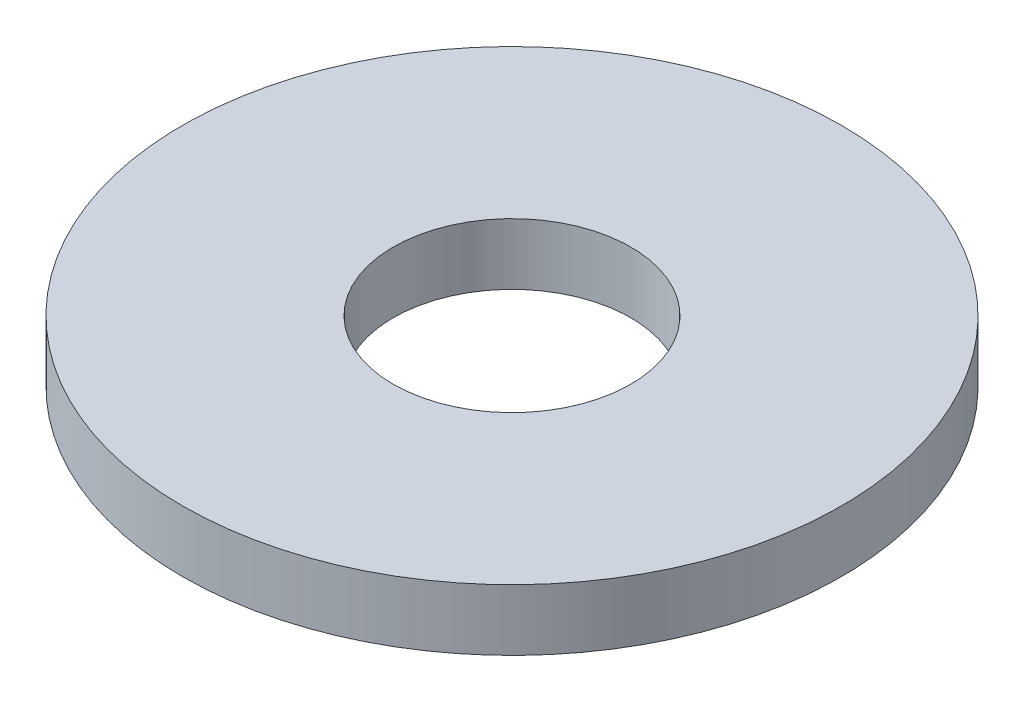
ISO-10303-21;
HEADER;
FILE_DESCRIPTION(('STEP AP214'),'2;1');
FILE_NAME('part.step','',(''),(''),'','','');
FILE_SCHEMA(('AUTOMOTIVE_DESIGN { 1 0 10303 214 1 1 1 1 }'));
ENDSEC;
DATA;
#1=APPLICATION_CONTEXT('core data for automotive mechanical design processes');
#2=APPLICATION_PROTOCOL_DEFINITION('international standard','automotive_design',2000,#1);
#3=PRODUCT_CONTEXT('',#1,'mechanical');
#4=PRODUCT('Part','Part','',(#3));
#5=PRODUCT_RELATED_PRODUCT_CATEGORY('part','',(#4));
#6=PRODUCT_DEFINITION_FORMATION('','',#4);
#7=PRODUCT_DEFINITION_CONTEXT('part definition',#1,'design');
#8=PRODUCT_DEFINITION('design','',#6,#7);
#9=PRODUCT_DEFINITION_SHAPE('','',#8);
#10=(LENGTH_UNIT() NAMED_UNIT(*) SI_UNIT(.MILLI.,.METRE.));
#11=(NAMED_UNIT(*) PLANE_ANGLE_UNIT() SI_UNIT($,.RADIAN.));
#12=(NAMED_UNIT(*) SI_UNIT($,.STERADIAN.) SOLID_ANGLE_UNIT());
#13=UNCERTAINTY_MEASURE_WITH_UNIT(LENGTH_MEASURE(1.E-05),#10,'distance_accuracy_value','');
#14=(GEOMETRIC_REPRESENTATION_CONTEXT(3) GLOBAL_UNCERTAINTY_ASSIGNED_CONTEXT((#13)) GLOBAL_UNIT_ASSIGNED_CONTEXT((#10,
#11,#12)) REPRESENTATION_CONTEXT('',''));
#15=CARTESIAN_POINT('',(0.,0.,0.));
#16=DIRECTION('',(0.,0.,1.));
#17=DIRECTION('',(1.,0.,0.));
#18=AXIS2_PLACEMENT_3D('',#15,#16,#17);
#19=CARTESIAN_POINT('',(0.,1.65,0.));
#20=DIRECTION('',(0.,1.,0.));
#21=DIRECTION('',(0.,0.,1.));
#22=AXIS2_PLACEMENT_3D('',#19,#20,#21);
#23=PLANE('',#22);
#24=CARTESIAN_POINT('',(0.,1.65,0.));
#25=DIRECTION('',(0.,1.,0.));
#26=DIRECTION('',(0.,0.,1.));
#27=AXIS2_PLACEMENT_3D('',#24,#25,#26);
#28=CIRCLE('',#27,8.875);
#29=CARTESIAN_POINT('',(0.,1.65,8.875));
#30=VERTEX_POINT('',#29);
#31=EDGE_CURVE('E10',#30,#30,#28,.T.);
#32=ORIENTED_EDGE('',*,*,#31,.T.);
#33=EDGE_LOOP('',(#32));
#34=FACE_BOUND('',#33,.T.);
#35=CARTESIAN_POINT('',(0.,1.65,0.));
#36=DIRECTION('',(0.,1.,0.));
#37=DIRECTION('',(0.,0.,1.));
#38=AXIS2_PLACEMENT_3D('',#35,#36,#37);
#39=CIRCLE('',#38,3.2);
#40=CARTESIAN_POINT('',(0.,1.65,3.2));
#41=VERTEX_POINT('',#40);
#42=EDGE_CURVE('E43',#41,#41,#39,.T.);
#43=ORIENTED_EDGE('',*,*,#42,.F.);
#44=EDGE_LOOP('',(#43));
#45=FACE_BOUND('',#44,.T.);
#46=ADVANCED_FACE('F32',(#34,#45),#23,.T.);
#47=CARTESIAN_POINT('',(0.,0.,0.));
#48=DIRECTION('',(0.,1.,0.));
#49=DIRECTION('',(0.,0.,1.));
#50=AXIS2_PLACEMENT_3D('',#47,#48,#49);
#51=PLANE('',#50);
#52=CARTESIAN_POINT('',(0.,0.,0.));
#53=DIRECTION('',(0.,1.,0.));
#54=DIRECTION('',(0.,0.,1.));
#55=AXIS2_PLACEMENT_3D('',#52,#53,#54);
#56=CIRCLE('',#55,8.875);
#57=CARTESIAN_POINT('',(0.,0.,8.875));
#58=VERTEX_POINT('',#57);
#59=EDGE_CURVE('E36',#58,#58,#56,.T.);
#60=ORIENTED_EDGE('',*,*,#59,.F.);
#61=EDGE_LOOP('',(#60));
#62=FACE_BOUND('',#61,.T.);
#63=CARTESIAN_POINT('',(0.,0.,0.));
#64=DIRECTION('',(0.,1.,0.));
#65=DIRECTION('',(0.,0.,1.));
#66=AXIS2_PLACEMENT_3D('',#63,#64,#65);
#67=CIRCLE('',#66,3.2);
#68=CARTESIAN_POINT('',(0.,0.,3.2));
#69=VERTEX_POINT('',#68);
#70=EDGE_CURVE('E45',#69,#69,#67,.T.);
#71=ORIENTED_EDGE('',*,*,#70,.T.);
#72=EDGE_LOOP('',(#71));
#73=FACE_BOUND('',#72,.T.);
#74=ADVANCED_FACE('F55',(#62,#73),#51,.F.);
#75=CARTESIAN_POINT('',(0.,1.65,0.));
#76=DIRECTION('',(0.,-1.,0.));
#77=DIRECTION('',(0.,0.,-1.));
#78=AXIS2_PLACEMENT_3D('',#75,#76,#77);
#79=CYLINDRICAL_SURFACE('',#78,8.875);
#80=ORIENTED_EDGE('',*,*,#31,.F.);
#81=EDGE_LOOP('',(#80));
#82=FACE_BOUND('',#81,.T.);
#83=ORIENTED_EDGE('',*,*,#59,.T.);
#84=EDGE_LOOP('',(#83));
#85=FACE_BOUND('',#84,.T.);
#86=ADVANCED_FACE('F34',(#82,#85),#79,.T.);
#87=CARTESIAN_POINT('',(0.,1.65,0.));
#88=DIRECTION('',(0.,-1.,0.));
#89=DIRECTION('',(0.,0.,-1.));
#90=AXIS2_PLACEMENT_3D('',#87,#88,#89);
#91=CYLINDRICAL_SURFACE('',#90,3.2);
#92=ORIENTED_EDGE('',*,*,#42,.T.);
#93=EDGE_LOOP('',(#92));
#94=FACE_BOUND('',#93,.T.);
#95=ORIENTED_EDGE('',*,*,#70,.F.);
#96=EDGE_LOOP('',(#95));
#97=FACE_BOUND('',#96,.T.);
#98=ADVANCED_FACE('F51',(#94,#97),#91,.F.);
#99=CLOSED_SHELL('',(#46,#74,#86,#98));
#100=MANIFOLD_SOLID_BREP('B2',#99);
#101=ADVANCED_BREP_SHAPE_REPRESENTATION('',(#18,#100),#14);
#102=SHAPE_DEFINITION_REPRESENTATION(#9,#101);
ENDSEC;
END-ISO-10303-21;
